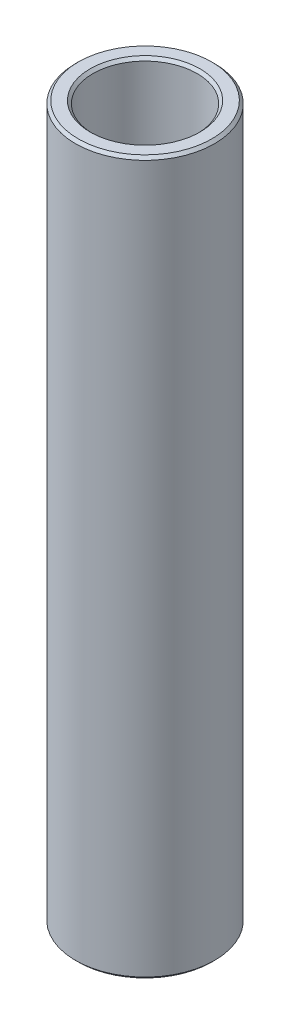
ISO-10303-21;
HEADER;
FILE_DESCRIPTION(('STEP AP214'),'2;1');
FILE_NAME('part.step','',(''),(''),'','','');
FILE_SCHEMA(('AUTOMOTIVE_DESIGN { 1 0 10303 214 1 1 1 1 }'));
ENDSEC;
DATA;
#1=APPLICATION_CONTEXT('core data for automotive mechanical design processes');
#2=APPLICATION_PROTOCOL_DEFINITION('international standard','automotive_design',2000,#1);
#3=PRODUCT_CONTEXT('',#1,'mechanical');
#4=PRODUCT('Part','Part','',(#3));
#5=PRODUCT_RELATED_PRODUCT_CATEGORY('part','',(#4));
#6=PRODUCT_DEFINITION_FORMATION('','',#4);
#7=PRODUCT_DEFINITION_CONTEXT('part definition',#1,'design');
#8=PRODUCT_DEFINITION('design','',#6,#7);
#9=PRODUCT_DEFINITION_SHAPE('','',#8);
#10=(LENGTH_UNIT() NAMED_UNIT(*) SI_UNIT(.MILLI.,.METRE.));
#11=(NAMED_UNIT(*) PLANE_ANGLE_UNIT() SI_UNIT($,.RADIAN.));
#12=(NAMED_UNIT(*) SI_UNIT($,.STERADIAN.) SOLID_ANGLE_UNIT());
#13=UNCERTAINTY_MEASURE_WITH_UNIT(LENGTH_MEASURE(1.E-05),#10,'distance_accuracy_value','');
#14=(GEOMETRIC_REPRESENTATION_CONTEXT(3) GLOBAL_UNCERTAINTY_ASSIGNED_CONTEXT((#13)) GLOBAL_UNIT_ASSIGNED_CONTEXT((#10,
#11,#12)) REPRESENTATION_CONTEXT('',''));
#15=CARTESIAN_POINT('',(0.,0.,0.));
#16=DIRECTION('',(0.,0.,1.));
#17=DIRECTION('',(1.,0.,0.));
#18=AXIS2_PLACEMENT_3D('',#15,#16,#17);
#19=CARTESIAN_POINT('',(6.35000000000029,70.6436949648143,0.));
#20=DIRECTION('',(0.,-1.,0.));
#21=DIRECTION('',(1.,0.,0.));
#22=AXIS2_PLACEMENT_3D('',#19,#20,#21);
#23=PLANE('',#22);
#24=CARTESIAN_POINT('',(0.,70.6436949648143,0.));
#25=DIRECTION('',(0.,-1.,0.));
#26=DIRECTION('',(1.,0.,0.));
#27=AXIS2_PLACEMENT_3D('',#24,#25,#26);
#28=CIRCLE('',#27,5.01650000000003);
#29=CARTESIAN_POINT('',(5.01650000000004,70.6436949648143,0.));
#30=VERTEX_POINT('',#29);
#31=EDGE_CURVE('E10',#30,#30,#28,.F.);
#32=ORIENTED_EDGE('',*,*,#31,.T.);
#33=EDGE_LOOP('',(#32));
#34=FACE_BOUND('',#33,.T.);
#35=CARTESIAN_POINT('',(0.,70.6436949648143,0.));
#36=DIRECTION('',(0.,-1.,0.));
#37=DIRECTION('',(1.,0.,0.));
#38=AXIS2_PLACEMENT_3D('',#35,#36,#37);
#39=CIRCLE('',#38,6.09600000000027);
#40=CARTESIAN_POINT('',(6.09600000000028,70.6436949648143,0.));
#41=VERTEX_POINT('',#40);
#42=EDGE_CURVE('E38',#41,#41,#39,.T.);
#43=ORIENTED_EDGE('',*,*,#42,.T.);
#44=EDGE_LOOP('',(#43));
#45=FACE_BOUND('',#44,.T.);
#46=ADVANCED_FACE('F31',(#34,#45),#23,.T.);
#47=CARTESIAN_POINT('',(0.,61.1186949648143,0.));
#48=DIRECTION('',(0.,-1.,0.));
#49=DIRECTION('',(1.,0.,0.));
#50=AXIS2_PLACEMENT_3D('',#47,#48,#49);
#51=CYLINDRICAL_SURFACE('',#50,4.76249999999997);
#52=CARTESIAN_POINT('',(0.,135.525129176711,0.));
#53=DIRECTION('',(0.,1.,0.));
#54=DIRECTION('',(-1.,0.,0.));
#55=AXIS2_PLACEMENT_3D('',#52,#53,#54);
#56=CIRCLE('',#55,4.76249999999997);
#57=CARTESIAN_POINT('',(-4.7624999999999,135.525129176711,0.));
#58=VERTEX_POINT('',#57);
#59=EDGE_CURVE('E42',#58,#58,#56,.T.);
#60=ORIENTED_EDGE('',*,*,#59,.T.);
#61=EDGE_LOOP('',(#60));
#62=FACE_BOUND('',#61,.T.);
#63=CARTESIAN_POINT('',(0.,70.8976949648143,0.));
#64=DIRECTION('',(0.,-1.,0.));
#65=DIRECTION('',(1.,0.,0.));
#66=AXIS2_PLACEMENT_3D('',#63,#64,#65);
#67=CIRCLE('',#66,4.76249999999997);
#68=CARTESIAN_POINT('',(4.76249999999998,70.8976949648143,0.));
#69=VERTEX_POINT('',#68);
#70=EDGE_CURVE('E46',#69,#69,#67,.T.);
#71=ORIENTED_EDGE('',*,*,#70,.T.);
#72=EDGE_LOOP('',(#71));
#73=FACE_BOUND('',#72,.T.);
#74=ADVANCED_FACE('F75',(#62,#73),#51,.F.);
#75=CARTESIAN_POINT('',(4.76250000000001,135.779129176711,0.));
#76=DIRECTION('',(0.,1.,0.));
#77=DIRECTION('',(-1.,0.,0.));
#78=AXIS2_PLACEMENT_3D('',#75,#76,#77);
#79=PLANE('',#78);
#80=CARTESIAN_POINT('',(0.,135.779129176711,0.));
#81=DIRECTION('',(0.,1.,0.));
#82=DIRECTION('',(-1.,0.,0.));
#83=AXIS2_PLACEMENT_3D('',#80,#81,#82);
#84=CIRCLE('',#83,6.09600000000018);
#85=CARTESIAN_POINT('',(-6.09600000000011,135.779129176711,0.));
#86=VERTEX_POINT('',#85);
#87=EDGE_CURVE('E51',#86,#86,#84,.T.);
#88=ORIENTED_EDGE('',*,*,#87,.T.);
#89=EDGE_LOOP('',(#88));
#90=FACE_BOUND('',#89,.T.);
#91=CARTESIAN_POINT('',(0.,135.779129176711,0.));
#92=DIRECTION('',(0.,1.,0.));
#93=DIRECTION('',(-1.,0.,0.));
#94=AXIS2_PLACEMENT_3D('',#91,#92,#93);
#95=CIRCLE('',#94,5.01649999999994);
#96=CARTESIAN_POINT('',(-5.01649999999986,135.779129176711,0.));
#97=VERTEX_POINT('',#96);
#98=EDGE_CURVE('E54',#97,#97,#95,.F.);
#99=ORIENTED_EDGE('',*,*,#98,.T.);
#100=EDGE_LOOP('',(#99));
#101=FACE_BOUND('',#100,.T.);
#102=ADVANCED_FACE('F80',(#90,#101),#79,.T.);
#103=CARTESIAN_POINT('',(0.,61.1186949648143,0.));
#104=DIRECTION('',(0.,-1.,0.));
#105=DIRECTION('',(1.,0.,0.));
#106=AXIS2_PLACEMENT_3D('',#103,#104,#105);
#107=CYLINDRICAL_SURFACE('',#106,6.35000000000024);
#108=CARTESIAN_POINT('',(0.,135.52512917671,0.));
#109=DIRECTION('',(0.,1.,0.));
#110=DIRECTION('',(-1.,0.,0.));
#111=AXIS2_PLACEMENT_3D('',#108,#109,#110);
#112=CIRCLE('',#111,6.35000000000024);
#113=CARTESIAN_POINT('',(-6.35000000000017,135.52512917671,0.));
#114=VERTEX_POINT('',#113);
#115=EDGE_CURVE('E57',#114,#114,#112,.F.);
#116=ORIENTED_EDGE('',*,*,#115,.T.);
#117=EDGE_LOOP('',(#116));
#118=FACE_BOUND('',#117,.T.);
#119=CARTESIAN_POINT('',(0.,70.8976949648143,0.));
#120=DIRECTION('',(0.,-1.,0.));
#121=DIRECTION('',(1.,0.,0.));
#122=AXIS2_PLACEMENT_3D('',#119,#120,#121);
#123=CIRCLE('',#122,6.35000000000024);
#124=CARTESIAN_POINT('',(6.35000000000025,70.8976949648143,0.));
#125=VERTEX_POINT('',#124);
#126=EDGE_CURVE('E60',#125,#125,#123,.F.);
#127=ORIENTED_EDGE('',*,*,#126,.T.);
#128=EDGE_LOOP('',(#127));
#129=FACE_BOUND('',#128,.T.);
#130=ADVANCED_FACE('F64',(#118,#129),#107,.T.);
#131=CARTESIAN_POINT('',(0.,135.52512917671,0.));
#132=DIRECTION('',(0.,-1.,0.));
#133=DIRECTION('',(1.,0.,0.));
#134=AXIS2_PLACEMENT_3D('',#131,#132,#133);
#135=CONICAL_SURFACE('',#134,6.35000000000024,0.785398163397438);
#136=ORIENTED_EDGE('',*,*,#87,.F.);
#137=EDGE_LOOP('',(#136));
#138=FACE_BOUND('',#137,.T.);
#139=ORIENTED_EDGE('',*,*,#115,.F.);
#140=EDGE_LOOP('',(#139));
#141=FACE_BOUND('',#140,.T.);
#142=ADVANCED_FACE('F85',(#138,#141),#135,.T.);
#143=CARTESIAN_POINT('',(0.,135.779129176711,0.));
#144=DIRECTION('',(0.,1.,0.));
#145=DIRECTION('',(-1.,0.,0.));
#146=AXIS2_PLACEMENT_3D('',#143,#144,#145);
#147=CONICAL_SURFACE('',#146,5.01649999999993,0.785398163397474);
#148=ORIENTED_EDGE('',*,*,#59,.F.);
#149=EDGE_LOOP('',(#148));
#150=FACE_BOUND('',#149,.T.);
#151=ORIENTED_EDGE('',*,*,#98,.F.);
#152=EDGE_LOOP('',(#151));
#153=FACE_BOUND('',#152,.T.);
#154=ADVANCED_FACE('F72',(#150,#153),#147,.F.);
#155=CARTESIAN_POINT('',(0.,70.8976949648143,0.));
#156=DIRECTION('',(0.,-1.,0.));
#157=DIRECTION('',(1.,0.,0.));
#158=AXIS2_PLACEMENT_3D('',#155,#156,#157);
#159=CONICAL_SURFACE('',#158,4.76249999999997,0.785398163397477);
#160=ORIENTED_EDGE('',*,*,#31,.F.);
#161=EDGE_LOOP('',(#160));
#162=FACE_BOUND('',#161,.T.);
#163=ORIENTED_EDGE('',*,*,#70,.F.);
#164=EDGE_LOOP('',(#163));
#165=FACE_BOUND('',#164,.T.);
#166=ADVANCED_FACE('F68',(#162,#165),#159,.F.);
#167=CARTESIAN_POINT('',(0.,70.6436949648143,0.));
#168=DIRECTION('',(0.,1.,0.));
#169=DIRECTION('',(-1.,0.,0.));
#170=AXIS2_PLACEMENT_3D('',#167,#168,#169);
#171=CONICAL_SURFACE('',#170,6.09600000000028,0.785398163397469);
#172=ORIENTED_EDGE('',*,*,#126,.F.);
#173=EDGE_LOOP('',(#172));
#174=FACE_BOUND('',#173,.T.);
#175=ORIENTED_EDGE('',*,*,#42,.F.);
#176=EDGE_LOOP('',(#175));
#177=FACE_BOUND('',#176,.T.);
#178=ADVANCED_FACE('F33',(#174,#177),#171,.T.);
#179=CLOSED_SHELL('',(#46,#74,#102,#130,#142,#154,#166,#178));
#180=MANIFOLD_SOLID_BREP('B2',#179);
#181=ADVANCED_BREP_SHAPE_REPRESENTATION('',(#18,#180),#14);
#182=SHAPE_DEFINITION_REPRESENTATION(#9,#181);
ENDSEC;
END-ISO-10303-21;
